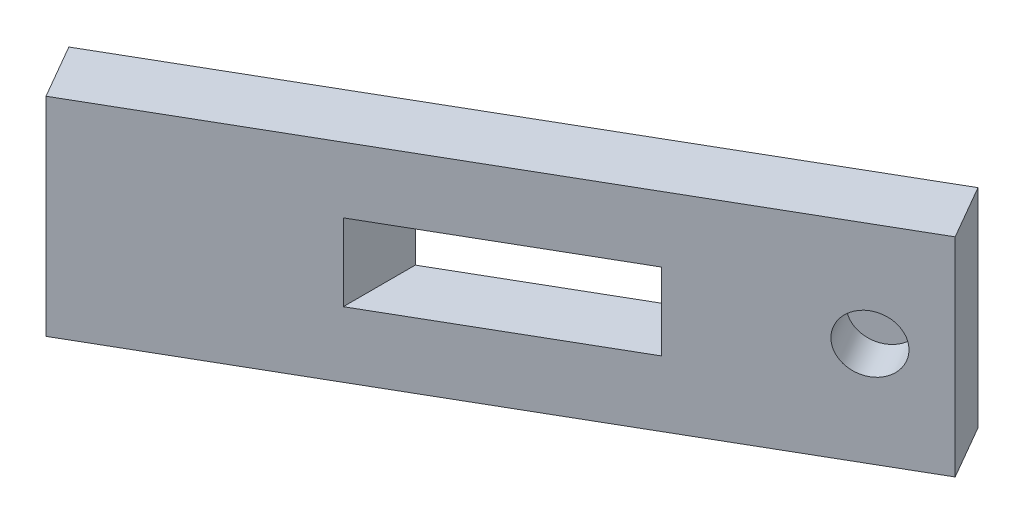
ISO-10303-21;
HEADER;
FILE_DESCRIPTION(('STEP AP214'),'2;1');
FILE_NAME('part.step','',(''),(''),'','','');
FILE_SCHEMA(('AUTOMOTIVE_DESIGN { 1 0 10303 214 1 1 1 1 }'));
ENDSEC;
DATA;
#1=APPLICATION_CONTEXT('core data for automotive mechanical design processes');
#2=APPLICATION_PROTOCOL_DEFINITION('international standard','automotive_design',2000,#1);
#3=PRODUCT_CONTEXT('',#1,'mechanical');
#4=PRODUCT('Part','Part','',(#3));
#5=PRODUCT_RELATED_PRODUCT_CATEGORY('part','',(#4));
#6=PRODUCT_DEFINITION_FORMATION('','',#4);
#7=PRODUCT_DEFINITION_CONTEXT('part definition',#1,'design');
#8=PRODUCT_DEFINITION('design','',#6,#7);
#9=PRODUCT_DEFINITION_SHAPE('','',#8);
#10=(LENGTH_UNIT() NAMED_UNIT(*) SI_UNIT(.MILLI.,.METRE.));
#11=(NAMED_UNIT(*) PLANE_ANGLE_UNIT() SI_UNIT($,.RADIAN.));
#12=(NAMED_UNIT(*) SI_UNIT($,.STERADIAN.) SOLID_ANGLE_UNIT());
#13=UNCERTAINTY_MEASURE_WITH_UNIT(LENGTH_MEASURE(1.E-05),#10,'distance_accuracy_value','');
#14=(GEOMETRIC_REPRESENTATION_CONTEXT(3) GLOBAL_UNCERTAINTY_ASSIGNED_CONTEXT((#13)) GLOBAL_UNIT_ASSIGNED_CONTEXT((#10,
#11,#12)) REPRESENTATION_CONTEXT('',''));
#15=CARTESIAN_POINT('',(0.,0.,0.));
#16=DIRECTION('',(0.,0.,1.));
#17=DIRECTION('',(1.,0.,0.));
#18=AXIS2_PLACEMENT_3D('',#15,#16,#17);
#19=CARTESIAN_POINT('',(3.29527845875009,-5.,-10.0619200876839));
#20=DIRECTION('',(0.5,0.,0.866025403784439));
#21=DIRECTION('',(0.866025403784439,0.,-0.5));
#22=AXIS2_PLACEMENT_3D('',#19,#20,#21);
#23=PLANE('',#22);
#24=CARTESIAN_POINT('',(0.697202247396775,0.,-8.56192008768393));
#25=DIRECTION('',(0.5,0.,0.866025403784439));
#26=DIRECTION('',(0.866025403784439,0.,-0.5));
#27=AXIS2_PLACEMENT_3D('',#24,#25,#26);
#28=CIRCLE('',#27,1.375);
#29=CARTESIAN_POINT('',(1.88798717760038,0.,-9.24942008768393));
#30=VERTEX_POINT('',#29);
#31=EDGE_CURVE('E212',#30,#30,#28,.T.);
#32=ORIENTED_EDGE('',*,*,#31,.F.);
#33=EDGE_LOOP('',(#32));
#34=FACE_BOUND('',#33,.T.);
#35=DIRECTION('',(0.,1.,0.));
#36=VECTOR('',#35,1.);
#37=CARTESIAN_POINT('',(3.29527845875009,-5.,-10.0619200876839));
#38=LINE('',#37,#36);
#39=CARTESIAN_POINT('',(3.29527845875009,-5.,-10.0619200876839));
#40=VERTEX_POINT('',#39);
#41=CARTESIAN_POINT('',(3.29527845875009,5.,-10.0619200876839));
#42=VERTEX_POINT('',#41);
#43=EDGE_CURVE('E36',#40,#42,#38,.T.);
#44=ORIENTED_EDGE('',*,*,#43,.T.);
#45=DIRECTION('',(0.866025403784439,0.,-0.5));
#46=VECTOR('',#45,1.);
#47=CARTESIAN_POINT('',(3.29527845875009,5.,-10.0619200876839));
#48=LINE('',#47,#46);
#49=CARTESIAN_POINT('',(-24.4175344623519,5.,5.93807991231608));
#50=VERTEX_POINT('',#49);
#51=EDGE_CURVE('E125',#50,#42,#48,.T.);
#52=ORIENTED_EDGE('',*,*,#51,.F.);
#53=DIRECTION('',(0.,1.,0.));
#54=VECTOR('',#53,1.);
#55=CARTESIAN_POINT('',(-24.4175344623519,-5.,5.93807991231608));
#56=LINE('',#55,#54);
#57=CARTESIAN_POINT('',(-24.4175344623519,-5.,5.93807991231608));
#58=VERTEX_POINT('',#57);
#59=EDGE_CURVE('E11',#58,#50,#56,.T.);
#60=ORIENTED_EDGE('',*,*,#59,.F.);
#61=DIRECTION('',(0.866025403784439,0.,-0.5));
#62=VECTOR('',#61,1.);
#63=CARTESIAN_POINT('',(3.29527845875009,-5.,-10.0619200876839));
#64=LINE('',#63,#62);
#65=EDGE_CURVE('E138',#58,#40,#64,.T.);
#66=ORIENTED_EDGE('',*,*,#65,.T.);
#67=EDGE_LOOP('',(#44,#52,#60,#66));
#68=FACE_BOUND('',#67,.T.);
#69=DIRECTION('',(0.,1.,0.));
#70=VECTOR('',#69,1.);
#71=CARTESIAN_POINT('',(-5.65631853018422,-1.85,-4.89371315644565));
#72=LINE('',#71,#70);
#73=CARTESIAN_POINT('',(-5.65631853018422,-1.85,-4.89371315644565));
#74=VERTEX_POINT('',#73);
#75=CARTESIAN_POINT('',(-5.65631853018422,1.85,-4.89371315644565));
#76=VERTEX_POINT('',#75);
#77=EDGE_CURVE('E120',#74,#76,#72,.T.);
#78=ORIENTED_EDGE('',*,*,#77,.F.);
#79=DIRECTION('',(0.866025403784439,0.,-0.5));
#80=VECTOR('',#79,1.);
#81=CARTESIAN_POINT('',(-3.53311958870409,-1.85,-6.11954263685234));
#82=LINE('',#81,#80);
#83=CARTESIAN_POINT('',(-15.3563185301842,-1.85,0.706584454693716));
#84=VERTEX_POINT('',#83);
#85=EDGE_CURVE('E107',#84,#74,#82,.T.);
#86=ORIENTED_EDGE('',*,*,#85,.F.);
#87=DIRECTION('',(0.,1.,0.));
#88=VECTOR('',#87,1.);
#89=CARTESIAN_POINT('',(-15.3563185301842,-1.85,0.706584454693716));
#90=LINE('',#89,#88);
#91=CARTESIAN_POINT('',(-15.3563185301842,1.85,0.706584454693716));
#92=VERTEX_POINT('',#91);
#93=EDGE_CURVE('E103',#84,#92,#90,.T.);
#94=ORIENTED_EDGE('',*,*,#93,.T.);
#95=DIRECTION('',(0.866025403784439,0.,-0.5));
#96=VECTOR('',#95,1.);
#97=CARTESIAN_POINT('',(-3.53311958870409,1.85,-6.11954263685234));
#98=LINE('',#97,#96);
#99=EDGE_CURVE('E220',#92,#76,#98,.T.);
#100=ORIENTED_EDGE('',*,*,#99,.T.);
#101=EDGE_LOOP('',(#78,#86,#94,#100));
#102=FACE_BOUND('',#101,.T.);
#103=ADVANCED_FACE('F33',(#34,#68,#102),#23,.T.);
#104=CARTESIAN_POINT('',(-25.9175344623519,-5.,3.34000370096276));
#105=DIRECTION('',(-0.5,0.,-0.866025403784439));
#106=DIRECTION('',(-0.866025403784439,0.,0.5));
#107=AXIS2_PLACEMENT_3D('',#104,#105,#106);
#108=PLANE('',#107);
#109=DIRECTION('',(0.,1.,0.));
#110=VECTOR('',#109,1.);
#111=CARTESIAN_POINT('',(-25.9175344623519,-5.,3.34000370096276));
#112=LINE('',#111,#110);
#113=CARTESIAN_POINT('',(-25.9175344623519,-5.,3.34000370096276));
#114=VERTEX_POINT('',#113);
#115=CARTESIAN_POINT('',(-25.9175344623519,5.,3.34000370096276));
#116=VERTEX_POINT('',#115);
#117=EDGE_CURVE('E41',#114,#116,#112,.T.);
#118=ORIENTED_EDGE('',*,*,#117,.T.);
#119=DIRECTION('',(-0.866025403784439,0.,0.5));
#120=VECTOR('',#119,1.);
#121=CARTESIAN_POINT('',(-25.9175344623519,5.,3.34000370096276));
#122=LINE('',#121,#120);
#123=CARTESIAN_POINT('',(1.79527845875009,5.,-12.6599962990372));
#124=VERTEX_POINT('',#123);
#125=EDGE_CURVE('E132',#124,#116,#122,.T.);
#126=ORIENTED_EDGE('',*,*,#125,.F.);
#127=DIRECTION('',(0.,1.,0.));
#128=VECTOR('',#127,1.);
#129=CARTESIAN_POINT('',(1.79527845875009,-5.,-12.6599962990372));
#130=LINE('',#129,#128);
#131=CARTESIAN_POINT('',(1.79527845875009,-5.,-12.6599962990372));
#132=VERTEX_POINT('',#131);
#133=EDGE_CURVE('E150',#132,#124,#130,.T.);
#134=ORIENTED_EDGE('',*,*,#133,.F.);
#135=DIRECTION('',(-0.866025403784439,0.,0.5));
#136=VECTOR('',#135,1.);
#137=CARTESIAN_POINT('',(-25.9175344623519,-5.,3.34000370096276));
#138=LINE('',#137,#136);
#139=EDGE_CURVE('E144',#132,#114,#138,.T.);
#140=ORIENTED_EDGE('',*,*,#139,.T.);
#141=EDGE_LOOP('',(#118,#126,#134,#140));
#142=FACE_BOUND('',#141,.T.);
#143=DIRECTION('',(0.,1.,0.));
#144=VECTOR('',#143,1.);
#145=CARTESIAN_POINT('',(-15.3563185301842,-1.85,-2.75751716044404));
#146=LINE('',#145,#144);
#147=CARTESIAN_POINT('',(-15.3563185301842,-1.85,-2.75751716044404));
#148=VERTEX_POINT('',#147);
#149=CARTESIAN_POINT('',(-15.3563185301842,1.85,-2.75751716044404));
#150=VERTEX_POINT('',#149);
#151=EDGE_CURVE('E100',#148,#150,#146,.T.);
#152=ORIENTED_EDGE('',*,*,#151,.F.);
#153=DIRECTION('',(-0.866025403784439,0.,0.5));
#154=VECTOR('',#153,1.);
#155=CARTESIAN_POINT('',(-5.03311958870409,-1.85,-8.71761884820565));
#156=LINE('',#155,#154);
#157=CARTESIAN_POINT('',(-5.65631853018422,-1.85,-8.3578147715834));
#158=VERTEX_POINT('',#157);
#159=EDGE_CURVE('E108',#158,#148,#156,.T.);
#160=ORIENTED_EDGE('',*,*,#159,.F.);
#161=DIRECTION('',(0.,1.,0.));
#162=VECTOR('',#161,1.);
#163=CARTESIAN_POINT('',(-5.65631853018422,-1.85,-8.3578147715834));
#164=LINE('',#163,#162);
#165=CARTESIAN_POINT('',(-5.65631853018422,1.85,-8.3578147715834));
#166=VERTEX_POINT('',#165);
#167=EDGE_CURVE('E129',#158,#166,#164,.T.);
#168=ORIENTED_EDGE('',*,*,#167,.T.);
#169=DIRECTION('',(-0.866025403784439,0.,0.5));
#170=VECTOR('',#169,1.);
#171=CARTESIAN_POINT('',(-5.03311958870409,1.85,-8.71761884820565));
#172=LINE('',#171,#170);
#173=EDGE_CURVE('E118',#166,#150,#172,.T.);
#174=ORIENTED_EDGE('',*,*,#173,.T.);
#175=EDGE_LOOP('',(#152,#160,#168,#174));
#176=FACE_BOUND('',#175,.T.);
#177=ADVANCED_FACE('F117',(#142,#176),#108,.T.);
#178=CARTESIAN_POINT('',(-24.4175344623519,-5.,5.93807991231608));
#179=DIRECTION('',(-0.866025403784438,0.,0.5));
#180=DIRECTION('',(0.5,0.,0.866025403784438));
#181=AXIS2_PLACEMENT_3D('',#178,#179,#180);
#182=PLANE('',#181);
#183=ORIENTED_EDGE('',*,*,#59,.T.);
#184=DIRECTION('',(0.5,0.,0.866025403784439));
#185=VECTOR('',#184,1.);
#186=CARTESIAN_POINT('',(-24.4175344623519,5.,5.93807991231608));
#187=LINE('',#186,#185);
#188=EDGE_CURVE('E135',#116,#50,#187,.T.);
#189=ORIENTED_EDGE('',*,*,#188,.F.);
#190=ORIENTED_EDGE('',*,*,#117,.F.);
#191=DIRECTION('',(0.5,0.,0.866025403784439));
#192=VECTOR('',#191,1.);
#193=CARTESIAN_POINT('',(-24.4175344623519,-5.,5.93807991231608));
#194=LINE('',#193,#192);
#195=EDGE_CURVE('E147',#114,#58,#194,.T.);
#196=ORIENTED_EDGE('',*,*,#195,.T.);
#197=EDGE_LOOP('',(#183,#189,#190,#196));
#198=FACE_BOUND('',#197,.T.);
#199=ADVANCED_FACE('F164',(#198),#182,.T.);
#200=CARTESIAN_POINT('',(1.79527845875009,-5.,-12.6599962990372));
#201=DIRECTION('',(0.866025403784438,0.,-0.5));
#202=DIRECTION('',(-0.5,0.,-0.866025403784438));
#203=AXIS2_PLACEMENT_3D('',#200,#201,#202);
#204=PLANE('',#203);
#205=ORIENTED_EDGE('',*,*,#133,.T.);
#206=DIRECTION('',(-0.5,0.,-0.866025403784438));
#207=VECTOR('',#206,1.);
#208=CARTESIAN_POINT('',(1.79527845875009,5.,-12.6599962990372));
#209=LINE('',#208,#207);
#210=EDGE_CURVE('E128',#42,#124,#209,.T.);
#211=ORIENTED_EDGE('',*,*,#210,.F.);
#212=ORIENTED_EDGE('',*,*,#43,.F.);
#213=DIRECTION('',(-0.5,0.,-0.866025403784438));
#214=VECTOR('',#213,1.);
#215=CARTESIAN_POINT('',(1.79527845875009,-5.,-12.6599962990372));
#216=LINE('',#215,#214);
#217=EDGE_CURVE('E141',#40,#132,#216,.T.);
#218=ORIENTED_EDGE('',*,*,#217,.T.);
#219=EDGE_LOOP('',(#205,#211,#212,#218));
#220=FACE_BOUND('',#219,.T.);
#221=ADVANCED_FACE('F158',(#220),#204,.T.);
#222=CARTESIAN_POINT('',(0.,-5.,0.));
#223=DIRECTION('',(0.,-1.,0.));
#224=DIRECTION('',(0.,0.,-1.));
#225=AXIS2_PLACEMENT_3D('',#222,#223,#224);
#226=PLANE('',#225);
#227=ORIENTED_EDGE('',*,*,#65,.F.);
#228=ORIENTED_EDGE('',*,*,#195,.F.);
#229=ORIENTED_EDGE('',*,*,#139,.F.);
#230=ORIENTED_EDGE('',*,*,#217,.F.);
#231=EDGE_LOOP('',(#227,#228,#229,#230));
#232=FACE_BOUND('',#231,.T.);
#233=ADVANCED_FACE('F167',(#232),#226,.T.);
#234=CARTESIAN_POINT('',(0.,5.,0.));
#235=DIRECTION('',(0.,-1.,0.));
#236=DIRECTION('',(0.,0.,-1.));
#237=AXIS2_PLACEMENT_3D('',#234,#235,#236);
#238=PLANE('',#237);
#239=ORIENTED_EDGE('',*,*,#51,.T.);
#240=ORIENTED_EDGE('',*,*,#210,.T.);
#241=ORIENTED_EDGE('',*,*,#125,.T.);
#242=ORIENTED_EDGE('',*,*,#188,.T.);
#243=EDGE_LOOP('',(#239,#240,#241,#242));
#244=FACE_BOUND('',#243,.T.);
#245=ADVANCED_FACE('F161',(#244),#238,.F.);
#246=CARTESIAN_POINT('',(-5.65631853018422,-1.85,0.));
#247=DIRECTION('',(-1.,0.,0.));
#248=DIRECTION('',(0.,0.,1.));
#249=AXIS2_PLACEMENT_3D('',#246,#247,#248);
#250=PLANE('',#249);
#251=DIRECTION('',(0.,0.,1.));
#252=VECTOR('',#251,1.);
#253=CARTESIAN_POINT('',(-5.65631853018422,1.85,0.));
#254=LINE('',#253,#252);
#255=EDGE_CURVE('E49',#166,#76,#254,.T.);
#256=ORIENTED_EDGE('',*,*,#255,.F.);
#257=ORIENTED_EDGE('',*,*,#167,.F.);
#258=DIRECTION('',(0.,0.,1.));
#259=VECTOR('',#258,1.);
#260=CARTESIAN_POINT('',(-5.65631853018422,-1.85,0.));
#261=LINE('',#260,#259);
#262=EDGE_CURVE('E113',#158,#74,#261,.T.);
#263=ORIENTED_EDGE('',*,*,#262,.T.);
#264=ORIENTED_EDGE('',*,*,#77,.T.);
#265=EDGE_LOOP('',(#256,#257,#263,#264));
#266=FACE_BOUND('',#265,.T.);
#267=ADVANCED_FACE('F187',(#266),#250,.T.);
#268=CARTESIAN_POINT('',(-15.3563185301842,-1.85,0.));
#269=DIRECTION('',(-1.,0.,0.));
#270=DIRECTION('',(0.,0.,1.));
#271=AXIS2_PLACEMENT_3D('',#268,#269,#270);
#272=PLANE('',#271);
#273=DIRECTION('',(0.,0.,1.));
#274=VECTOR('',#273,1.);
#275=CARTESIAN_POINT('',(-15.3563185301842,1.85,0.));
#276=LINE('',#275,#274);
#277=EDGE_CURVE('E54',#150,#92,#276,.T.);
#278=ORIENTED_EDGE('',*,*,#277,.T.);
#279=ORIENTED_EDGE('',*,*,#93,.F.);
#280=DIRECTION('',(0.,0.,1.));
#281=VECTOR('',#280,1.);
#282=CARTESIAN_POINT('',(-15.3563185301842,-1.85,0.));
#283=LINE('',#282,#281);
#284=EDGE_CURVE('E96',#148,#84,#283,.T.);
#285=ORIENTED_EDGE('',*,*,#284,.F.);
#286=ORIENTED_EDGE('',*,*,#151,.T.);
#287=EDGE_LOOP('',(#278,#279,#285,#286));
#288=FACE_BOUND('',#287,.T.);
#289=ADVANCED_FACE('F98',(#288),#272,.F.);
#290=CARTESIAN_POINT('',(0.,-1.85,0.));
#291=DIRECTION('',(0.,1.,0.));
#292=DIRECTION('',(0.,0.,1.));
#293=AXIS2_PLACEMENT_3D('',#290,#291,#292);
#294=PLANE('',#293);
#295=ORIENTED_EDGE('',*,*,#159,.T.);
#296=ORIENTED_EDGE('',*,*,#284,.T.);
#297=ORIENTED_EDGE('',*,*,#85,.T.);
#298=ORIENTED_EDGE('',*,*,#262,.F.);
#299=EDGE_LOOP('',(#295,#296,#297,#298));
#300=FACE_BOUND('',#299,.T.);
#301=ADVANCED_FACE('F112',(#300),#294,.T.);
#302=CARTESIAN_POINT('',(0.,1.85,0.));
#303=DIRECTION('',(0.,1.,0.));
#304=DIRECTION('',(0.,0.,1.));
#305=AXIS2_PLACEMENT_3D('',#302,#303,#304);
#306=PLANE('',#305);
#307=ORIENTED_EDGE('',*,*,#173,.F.);
#308=ORIENTED_EDGE('',*,*,#255,.T.);
#309=ORIENTED_EDGE('',*,*,#99,.F.);
#310=ORIENTED_EDGE('',*,*,#277,.F.);
#311=EDGE_LOOP('',(#307,#308,#309,#310));
#312=FACE_BOUND('',#311,.T.);
#313=ADVANCED_FACE('F195',(#312),#306,.F.);
#314=CARTESIAN_POINT('',(-0.302797752603226,0.,-10.2939708952528));
#315=DIRECTION('',(0.5,0.,0.866025403784439));
#316=DIRECTION('',(0.866025403784439,0.,-0.5));
#317=AXIS2_PLACEMENT_3D('',#314,#315,#316);
#318=CYLINDRICAL_SURFACE('',#317,1.375);
#319=CARTESIAN_POINT('',(-0.302797752603226,0.,-10.2939708952528));
#320=DIRECTION('',(0.5,0.,0.866025403784439));
#321=DIRECTION('',(0.866025403784439,0.,-0.5));
#322=AXIS2_PLACEMENT_3D('',#319,#320,#321);
#323=CIRCLE('',#322,1.375);
#324=CARTESIAN_POINT('',(0.887987177600378,0.,-10.9814708952528));
#325=VERTEX_POINT('',#324);
#326=EDGE_CURVE('E211',#325,#325,#323,.T.);
#327=ORIENTED_EDGE('',*,*,#326,.F.);
#328=EDGE_LOOP('',(#327));
#329=FACE_BOUND('',#328,.T.);
#330=ORIENTED_EDGE('',*,*,#31,.T.);
#331=EDGE_LOOP('',(#330));
#332=FACE_BOUND('',#331,.T.);
#333=ADVANCED_FACE('F198',(#329,#332),#318,.F.);
#334=CARTESIAN_POINT('',(-0.302797752603226,0.,-10.2939708952528));
#335=DIRECTION('',(0.5,0.,0.866025403784439));
#336=DIRECTION('',(0.866025403784439,0.,-0.5));
#337=AXIS2_PLACEMENT_3D('',#334,#335,#336);
#338=PLANE('',#337);
#339=ORIENTED_EDGE('',*,*,#326,.T.);
#340=EDGE_LOOP('',(#339));
#341=FACE_BOUND('',#340,.T.);
#342=ADVANCED_FACE('F203',(#341),#338,.T.);
#343=CLOSED_SHELL('',(#103,#177,#199,#221,#233,#245,#267,#289,#301,#313,#333,#342));
#344=MANIFOLD_SOLID_BREP('B2',#343);
#345=ADVANCED_BREP_SHAPE_REPRESENTATION('',(#18,#344),#14);
#346=SHAPE_DEFINITION_REPRESENTATION(#9,#345);
ENDSEC;
END-ISO-10303-21;
